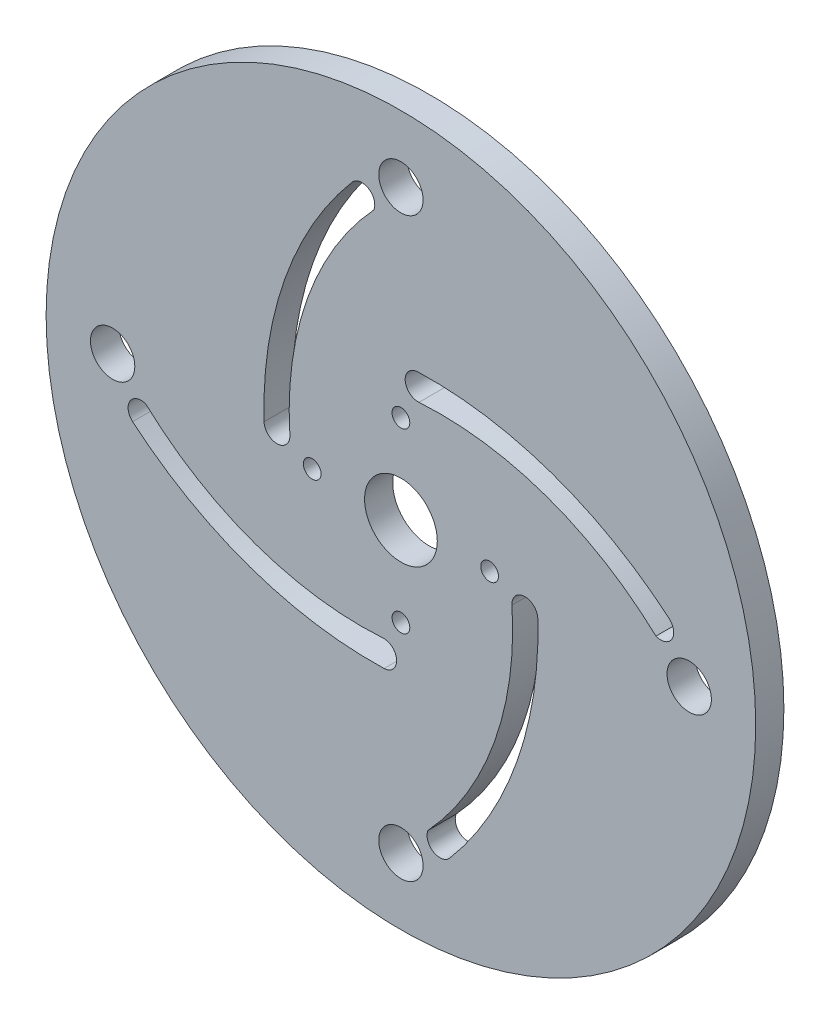
ISO-10303-21;
HEADER;
FILE_DESCRIPTION(('STEP AP214'),'2;1');
FILE_NAME('part.step','',(''),(''),'','','');
FILE_SCHEMA(('AUTOMOTIVE_DESIGN { 1 0 10303 214 1 1 1 1 }'));
ENDSEC;
DATA;
#1=APPLICATION_CONTEXT('core data for automotive mechanical design processes');
#2=APPLICATION_PROTOCOL_DEFINITION('international standard','automotive_design',2000,#1);
#3=PRODUCT_CONTEXT('',#1,'mechanical');
#4=PRODUCT('Part','Part','',(#3));
#5=PRODUCT_RELATED_PRODUCT_CATEGORY('part','',(#4));
#6=PRODUCT_DEFINITION_FORMATION('','',#4);
#7=PRODUCT_DEFINITION_CONTEXT('part definition',#1,'design');
#8=PRODUCT_DEFINITION('design','',#6,#7);
#9=PRODUCT_DEFINITION_SHAPE('','',#8);
#10=(LENGTH_UNIT() NAMED_UNIT(*) SI_UNIT(.MILLI.,.METRE.));
#11=(NAMED_UNIT(*) PLANE_ANGLE_UNIT() SI_UNIT($,.RADIAN.));
#12=(NAMED_UNIT(*) SI_UNIT($,.STERADIAN.) SOLID_ANGLE_UNIT());
#13=UNCERTAINTY_MEASURE_WITH_UNIT(LENGTH_MEASURE(1.E-05),#10,'distance_accuracy_value','');
#14=(GEOMETRIC_REPRESENTATION_CONTEXT(3) GLOBAL_UNCERTAINTY_ASSIGNED_CONTEXT((#13)) GLOBAL_UNIT_ASSIGNED_CONTEXT((#10,
#11,#12)) REPRESENTATION_CONTEXT('',''));
#15=CARTESIAN_POINT('',(0.,0.,0.));
#16=DIRECTION('',(0.,0.,1.));
#17=DIRECTION('',(1.,0.,0.));
#18=AXIS2_PLACEMENT_3D('',#15,#16,#17);
#19=CARTESIAN_POINT('',(0.,0.,3.175));
#20=DIRECTION('',(0.,0.,1.));
#21=DIRECTION('',(1.,0.,0.));
#22=AXIS2_PLACEMENT_3D('',#19,#20,#21);
#23=PLANE('',#22);
#24=CARTESIAN_POINT('',(-3.75211670479082E-13,-32.500000024,3.175));
#25=DIRECTION('',(0.,0.,1.));
#26=DIRECTION('',(1.,0.,0.));
#27=AXIS2_PLACEMENT_3D('',#24,#25,#26);
#28=CIRCLE('',#27,2.5);
#29=CARTESIAN_POINT('',(2.49999999999963,-32.500000024,3.175));
#30=VERTEX_POINT('',#29);
#31=EDGE_CURVE('E344',#30,#30,#28,.T.);
#32=ORIENTED_EDGE('',*,*,#31,.F.);
#33=EDGE_LOOP('',(#32));
#34=FACE_BOUND('',#33,.T.);
#35=CARTESIAN_POINT('',(0.,10.,3.175));
#36=DIRECTION('',(0.,0.,1.));
#37=DIRECTION('',(1.,0.,0.));
#38=AXIS2_PLACEMENT_3D('',#35,#36,#37);
#39=CIRCLE('',#38,1.);
#40=CARTESIAN_POINT('',(1.,10.,3.175));
#41=VERTEX_POINT('',#40);
#42=EDGE_CURVE('E360',#41,#41,#39,.T.);
#43=ORIENTED_EDGE('',*,*,#42,.F.);
#44=EDGE_LOOP('',(#43));
#45=FACE_BOUND('',#44,.T.);
#46=CARTESIAN_POINT('',(0.,-10.,3.175));
#47=DIRECTION('',(0.,0.,1.));
#48=DIRECTION('',(1.,0.,0.));
#49=AXIS2_PLACEMENT_3D('',#46,#47,#48);
#50=CIRCLE('',#49,1.);
#51=CARTESIAN_POINT('',(1.,-10.,3.175));
#52=VERTEX_POINT('',#51);
#53=EDGE_CURVE('E376',#52,#52,#50,.T.);
#54=ORIENTED_EDGE('',*,*,#53,.F.);
#55=EDGE_LOOP('',(#54));
#56=FACE_BOUND('',#55,.T.);
#57=CARTESIAN_POINT('',(10.,0.,3.175));
#58=DIRECTION('',(0.,0.,1.));
#59=DIRECTION('',(1.,0.,0.));
#60=AXIS2_PLACEMENT_3D('',#57,#58,#59);
#61=CIRCLE('',#60,1.);
#62=CARTESIAN_POINT('',(11.,0.,3.175));
#63=VERTEX_POINT('',#62);
#64=EDGE_CURVE('E392',#63,#63,#61,.T.);
#65=ORIENTED_EDGE('',*,*,#64,.F.);
#66=EDGE_LOOP('',(#65));
#67=FACE_BOUND('',#66,.T.);
#68=CARTESIAN_POINT('',(0.,0.,3.175));
#69=DIRECTION('',(0.,0.,1.));
#70=DIRECTION('',(1.,0.,0.));
#71=AXIS2_PLACEMENT_3D('',#68,#69,#70);
#72=CIRCLE('',#71,40.);
#73=CARTESIAN_POINT('',(40.,0.,3.175));
#74=VERTEX_POINT('',#73);
#75=EDGE_CURVE('E11',#74,#74,#72,.T.);
#76=ORIENTED_EDGE('',*,*,#75,.T.);
#77=EDGE_LOOP('',(#76));
#78=FACE_BOUND('',#77,.T.);
#79=CARTESIAN_POINT('',(0.,0.,3.175));
#80=DIRECTION('',(0.,0.,1.));
#81=DIRECTION('',(1.,0.,0.));
#82=AXIS2_PLACEMENT_3D('',#79,#80,#81);
#83=CIRCLE('',#82,4.1);
#84=CARTESIAN_POINT('',(4.1,0.,3.175));
#85=VERTEX_POINT('',#84);
#86=EDGE_CURVE('E400',#85,#85,#83,.T.);
#87=ORIENTED_EDGE('',*,*,#86,.F.);
#88=EDGE_LOOP('',(#87));
#89=FACE_BOUND('',#88,.T.);
#90=CARTESIAN_POINT('',(1.48265383286687E-13,32.500000024,3.175));
#91=DIRECTION('',(0.,0.,1.));
#92=DIRECTION('',(1.,0.,0.));
#93=AXIS2_PLACEMENT_3D('',#90,#91,#92);
#94=CIRCLE('',#93,2.5);
#95=CARTESIAN_POINT('',(2.50000000000015,32.500000024,3.175));
#96=VERTEX_POINT('',#95);
#97=EDGE_CURVE('E384',#96,#96,#94,.T.);
#98=ORIENTED_EDGE('',*,*,#97,.F.);
#99=EDGE_LOOP('',(#98));
#100=FACE_BOUND('',#99,.T.);
#101=CARTESIAN_POINT('',(-10.,0.,3.175));
#102=DIRECTION('',(0.,0.,1.));
#103=DIRECTION('',(1.,0.,0.));
#104=AXIS2_PLACEMENT_3D('',#101,#102,#103);
#105=CIRCLE('',#104,1.);
#106=CARTESIAN_POINT('',(-9.,0.,3.175));
#107=VERTEX_POINT('',#106);
#108=EDGE_CURVE('E368',#107,#107,#105,.T.);
#109=ORIENTED_EDGE('',*,*,#108,.F.);
#110=EDGE_LOOP('',(#109));
#111=FACE_BOUND('',#110,.T.);
#112=CARTESIAN_POINT('',(32.500000024,-2.68677420786791E-13,3.175));
#113=DIRECTION('',(0.,0.,1.));
#114=DIRECTION('',(1.,0.,0.));
#115=AXIS2_PLACEMENT_3D('',#112,#113,#114);
#116=CIRCLE('',#115,2.5);
#117=CARTESIAN_POINT('',(35.000000024,-2.68677420786791E-13,3.175));
#118=VERTEX_POINT('',#117);
#119=EDGE_CURVE('E352',#118,#118,#116,.T.);
#120=ORIENTED_EDGE('',*,*,#119,.F.);
#121=EDGE_LOOP('',(#120));
#122=FACE_BOUND('',#121,.T.);
#123=CARTESIAN_POINT('',(-32.500000024,4.88684814075279E-13,3.175));
#124=DIRECTION('',(0.,0.,1.));
#125=DIRECTION('',(1.,0.,0.));
#126=AXIS2_PLACEMENT_3D('',#123,#124,#125);
#127=CIRCLE('',#126,2.5);
#128=CARTESIAN_POINT('',(-30.000000024,4.88684814075279E-13,3.175));
#129=VERTEX_POINT('',#128);
#130=EDGE_CURVE('E336',#129,#129,#127,.T.);
#131=ORIENTED_EDGE('',*,*,#130,.F.);
#132=EDGE_LOOP('',(#131));
#133=FACE_BOUND('',#132,.T.);
#134=CARTESIAN_POINT('',(-23.2202833396125,-4.41366507691549,3.175));
#135=DIRECTION('',(0.,0.,-1.));
#136=DIRECTION('',(-1.,0.,0.));
#137=AXIS2_PLACEMENT_3D('',#134,#135,#136);
#138=CIRCLE('',#137,35.8185156656904);
#139=CARTESIAN_POINT('',(12.5190383342901,-2.03312925852839,3.175));
#140=VERTEX_POINT('',#139);
#141=CARTESIAN_POINT('',(3.05719626547229,-28.7541689767459,3.175));
#142=VERTEX_POINT('',#141);
#143=EDGE_CURVE('E296',#140,#142,#138,.T.);
#144=ORIENTED_EDGE('',*,*,#143,.F.);
#145=CARTESIAN_POINT('',(13.9727648667315,-1.93629899095386,3.175));
#146=DIRECTION('',(0.,0.,1.));
#147=DIRECTION('',(1.,0.,0.));
#148=AXIS2_PLACEMENT_3D('',#145,#146,#147);
#149=CIRCLE('',#148,1.45694781369915);
#150=CARTESIAN_POINT('',(15.4290656505906,-1.89288287903321,3.175));
#151=VERTEX_POINT('',#150);
#152=EDGE_CURVE('E293',#151,#140,#149,.T.);
#153=ORIENTED_EDGE('',*,*,#152,.F.);
#154=CARTESIAN_POINT('',(-26.464322347645,-3.14183367424383,3.175));
#155=DIRECTION('',(0.,0.,1.));
#156=DIRECTION('',(-1.,0.,0.));
#157=AXIS2_PLACEMENT_3D('',#154,#155,#156);
#158=CIRCLE('',#157,41.9120010982483);
#159=CARTESIAN_POINT('',(5.50574957064131,-30.244053834208,3.175));
#160=VERTEX_POINT('',#159);
#161=EDGE_CURVE('E304',#160,#151,#158,.T.);
#162=ORIENTED_EDGE('',*,*,#161,.F.);
#163=CARTESIAN_POINT('',(4.39905633511044,-29.305868778023,3.175));
#164=DIRECTION('',(0.,0.,1.));
#165=DIRECTION('',(1.,0.,0.));
#166=AXIS2_PLACEMENT_3D('',#163,#164,#165);
#167=CIRCLE('',#166,1.45084841290139);
#168=EDGE_CURVE('E300',#142,#160,#167,.T.);
#169=ORIENTED_EDGE('',*,*,#168,.F.);
#170=EDGE_LOOP('',(#144,#153,#162,#169));
#171=FACE_BOUND('',#170,.T.);
#172=CARTESIAN_POINT('',(4.41366507691547,-23.2202833396125,3.175));
#173=DIRECTION('',(0.,0.,-1.));
#174=DIRECTION('',(-1.,0.,0.));
#175=AXIS2_PLACEMENT_3D('',#172,#173,#174);
#176=CIRCLE('',#175,35.8185156656904);
#177=CARTESIAN_POINT('',(2.03312925852838,12.5190383342901,3.175));
#178=VERTEX_POINT('',#177);
#179=CARTESIAN_POINT('',(28.7541689767459,3.05719626547229,3.175));
#180=VERTEX_POINT('',#179);
#181=EDGE_CURVE('E253',#178,#180,#176,.T.);
#182=ORIENTED_EDGE('',*,*,#181,.F.);
#183=CARTESIAN_POINT('',(1.93629899095385,13.9727648667316,3.175));
#184=DIRECTION('',(0.,0.,1.));
#185=DIRECTION('',(1.,0.,0.));
#186=AXIS2_PLACEMENT_3D('',#183,#184,#185);
#187=CIRCLE('',#186,1.45694781369915);
#188=CARTESIAN_POINT('',(1.8928828790332,15.4290656505906,3.175));
#189=VERTEX_POINT('',#188);
#190=EDGE_CURVE('E250',#189,#178,#187,.T.);
#191=ORIENTED_EDGE('',*,*,#190,.F.);
#192=CARTESIAN_POINT('',(3.14183367424383,-26.464322347645,3.175));
#193=DIRECTION('',(0.,0.,1.));
#194=DIRECTION('',(-1.,0.,0.));
#195=AXIS2_PLACEMENT_3D('',#192,#193,#194);
#196=CIRCLE('',#195,41.9120010982483);
#197=CARTESIAN_POINT('',(30.244053834208,5.50574957064131,3.175));
#198=VERTEX_POINT('',#197);
#199=EDGE_CURVE('E261',#198,#189,#196,.T.);
#200=ORIENTED_EDGE('',*,*,#199,.F.);
#201=CARTESIAN_POINT('',(29.305868778023,4.39905633511044,3.175));
#202=DIRECTION('',(0.,0.,1.));
#203=DIRECTION('',(1.,0.,0.));
#204=AXIS2_PLACEMENT_3D('',#201,#202,#203);
#205=CIRCLE('',#204,1.45084841290139);
#206=EDGE_CURVE('E257',#180,#198,#205,.T.);
#207=ORIENTED_EDGE('',*,*,#206,.F.);
#208=EDGE_LOOP('',(#182,#191,#200,#207));
#209=FACE_BOUND('',#208,.T.);
#210=CARTESIAN_POINT('',(-4.41366507691548,23.2202833396125,3.175));
#211=DIRECTION('',(0.,0.,-1.));
#212=DIRECTION('',(-1.,0.,0.));
#213=AXIS2_PLACEMENT_3D('',#210,#211,#212);
#214=CIRCLE('',#213,35.8185156656904);
#215=CARTESIAN_POINT('',(-2.03312925852837,-12.5190383342901,3.175));
#216=VERTEX_POINT('',#215);
#217=CARTESIAN_POINT('',(-28.7541689767459,-3.05719626547229,3.175));
#218=VERTEX_POINT('',#217);
#219=EDGE_CURVE('E210',#216,#218,#214,.T.);
#220=ORIENTED_EDGE('',*,*,#219,.F.);
#221=CARTESIAN_POINT('',(-1.93629899095385,-13.9727648667316,3.175));
#222=DIRECTION('',(0.,0.,1.));
#223=DIRECTION('',(1.,0.,0.));
#224=AXIS2_PLACEMENT_3D('',#221,#222,#223);
#225=CIRCLE('',#224,1.45694781369915);
#226=CARTESIAN_POINT('',(-1.89288287903319,-15.4290656505906,3.175));
#227=VERTEX_POINT('',#226);
#228=EDGE_CURVE('E207',#227,#216,#225,.T.);
#229=ORIENTED_EDGE('',*,*,#228,.F.);
#230=CARTESIAN_POINT('',(-3.14183367424383,26.464322347645,3.175));
#231=DIRECTION('',(0.,0.,1.));
#232=DIRECTION('',(-1.,0.,0.));
#233=AXIS2_PLACEMENT_3D('',#230,#231,#232);
#234=CIRCLE('',#233,41.9120010982483);
#235=CARTESIAN_POINT('',(-30.244053834208,-5.50574957064132,3.175));
#236=VERTEX_POINT('',#235);
#237=EDGE_CURVE('E218',#236,#227,#234,.T.);
#238=ORIENTED_EDGE('',*,*,#237,.F.);
#239=CARTESIAN_POINT('',(-29.305868778023,-4.39905633511044,3.175));
#240=DIRECTION('',(0.,0.,1.));
#241=DIRECTION('',(1.,0.,0.));
#242=AXIS2_PLACEMENT_3D('',#239,#240,#241);
#243=CIRCLE('',#242,1.45084841290139);
#244=EDGE_CURVE('E214',#218,#236,#243,.T.);
#245=ORIENTED_EDGE('',*,*,#244,.F.);
#246=EDGE_LOOP('',(#220,#229,#238,#245));
#247=FACE_BOUND('',#246,.T.);
#248=CARTESIAN_POINT('',(23.2202833396125,4.41366507691549,3.175));
#249=DIRECTION('',(0.,0.,-1.));
#250=DIRECTION('',(-1.,0.,0.));
#251=AXIS2_PLACEMENT_3D('',#248,#249,#250);
#252=CIRCLE('',#251,35.8185156656904);
#253=CARTESIAN_POINT('',(-12.5190383342901,2.03312925852839,3.175));
#254=VERTEX_POINT('',#253);
#255=CARTESIAN_POINT('',(-3.0571962654723,28.7541689767459,3.175));
#256=VERTEX_POINT('',#255);
#257=EDGE_CURVE('E168',#254,#256,#252,.T.);
#258=ORIENTED_EDGE('',*,*,#257,.F.);
#259=CARTESIAN_POINT('',(-13.9727648667315,1.93629899095385,3.175));
#260=DIRECTION('',(0.,0.,1.));
#261=DIRECTION('',(1.,0.,0.));
#262=AXIS2_PLACEMENT_3D('',#259,#260,#261);
#263=CIRCLE('',#262,1.45694781369915);
#264=CARTESIAN_POINT('',(-15.4290656505906,1.89288287903319,3.175));
#265=VERTEX_POINT('',#264);
#266=EDGE_CURVE('E159',#265,#254,#263,.T.);
#267=ORIENTED_EDGE('',*,*,#266,.F.);
#268=CARTESIAN_POINT('',(26.464322347645,3.14183367424383,3.175));
#269=DIRECTION('',(0.,0.,1.));
#270=DIRECTION('',(-1.,0.,0.));
#271=AXIS2_PLACEMENT_3D('',#268,#269,#270);
#272=CIRCLE('',#271,41.9120010982483);
#273=CARTESIAN_POINT('',(-5.50574957064131,30.244053834208,3.175));
#274=VERTEX_POINT('',#273);
#275=EDGE_CURVE('E185',#274,#265,#272,.T.);
#276=ORIENTED_EDGE('',*,*,#275,.F.);
#277=CARTESIAN_POINT('',(-4.39905633511044,29.305868778023,3.175));
#278=DIRECTION('',(0.,0.,1.));
#279=DIRECTION('',(1.,0.,0.));
#280=AXIS2_PLACEMENT_3D('',#277,#278,#279);
#281=CIRCLE('',#280,1.45084841290139);
#282=EDGE_CURVE('E181',#256,#274,#281,.T.);
#283=ORIENTED_EDGE('',*,*,#282,.F.);
#284=EDGE_LOOP('',(#258,#267,#276,#283));
#285=FACE_BOUND('',#284,.T.);
#286=ADVANCED_FACE('F45',(#34,#45,#56,#67,#78,#89,#100,#111,#122,#133,#171,#209,#247,#285),#23,.T.);
#287=CARTESIAN_POINT('',(0.,0.,0.));
#288=DIRECTION('',(0.,0.,1.));
#289=DIRECTION('',(1.,0.,0.));
#290=AXIS2_PLACEMENT_3D('',#287,#288,#289);
#291=PLANE('',#290);
#292=CARTESIAN_POINT('',(-1.93629899095385,-13.9727648667316,0.));
#293=DIRECTION('',(0.,0.,1.));
#294=DIRECTION('',(1.,0.,0.));
#295=AXIS2_PLACEMENT_3D('',#292,#293,#294);
#296=CIRCLE('',#295,1.45694781369915);
#297=CARTESIAN_POINT('',(-1.89288287903319,-15.4290656505906,0.));
#298=VERTEX_POINT('',#297);
#299=CARTESIAN_POINT('',(-2.03312925852837,-12.5190383342901,0.));
#300=VERTEX_POINT('',#299);
#301=EDGE_CURVE('E177',#298,#300,#296,.T.);
#302=ORIENTED_EDGE('',*,*,#301,.T.);
#303=CARTESIAN_POINT('',(-4.41366507691548,23.2202833396125,0.));
#304=DIRECTION('',(0.,0.,-1.));
#305=DIRECTION('',(-1.,0.,0.));
#306=AXIS2_PLACEMENT_3D('',#303,#304,#305);
#307=CIRCLE('',#306,35.8185156656904);
#308=CARTESIAN_POINT('',(-28.7541689767459,-3.05719626547229,0.));
#309=VERTEX_POINT('',#308);
#310=EDGE_CURVE('E225',#300,#309,#307,.T.);
#311=ORIENTED_EDGE('',*,*,#310,.T.);
#312=CARTESIAN_POINT('',(-29.305868778023,-4.39905633511044,0.));
#313=DIRECTION('',(0.,0.,1.));
#314=DIRECTION('',(1.,0.,0.));
#315=AXIS2_PLACEMENT_3D('',#312,#313,#314);
#316=CIRCLE('',#315,1.45084841290139);
#317=CARTESIAN_POINT('',(-30.244053834208,-5.50574957064132,0.));
#318=VERTEX_POINT('',#317);
#319=EDGE_CURVE('E229',#309,#318,#316,.T.);
#320=ORIENTED_EDGE('',*,*,#319,.T.);
#321=CARTESIAN_POINT('',(-3.14183367424383,26.464322347645,0.));
#322=DIRECTION('',(0.,0.,1.));
#323=DIRECTION('',(-1.,0.,0.));
#324=AXIS2_PLACEMENT_3D('',#321,#322,#323);
#325=CIRCLE('',#324,41.9120010982483);
#326=EDGE_CURVE('E211',#318,#298,#325,.T.);
#327=ORIENTED_EDGE('',*,*,#326,.T.);
#328=EDGE_LOOP('',(#302,#311,#320,#327));
#329=FACE_BOUND('',#328,.T.);
#330=CARTESIAN_POINT('',(13.9727648667315,-1.93629899095386,0.));
#331=DIRECTION('',(0.,0.,1.));
#332=DIRECTION('',(1.,0.,0.));
#333=AXIS2_PLACEMENT_3D('',#330,#331,#332);
#334=CIRCLE('',#333,1.45694781369915);
#335=CARTESIAN_POINT('',(15.4290656505906,-1.89288287903321,0.));
#336=VERTEX_POINT('',#335);
#337=CARTESIAN_POINT('',(12.5190383342901,-2.03312925852839,0.));
#338=VERTEX_POINT('',#337);
#339=EDGE_CURVE('E292',#336,#338,#334,.T.);
#340=ORIENTED_EDGE('',*,*,#339,.T.);
#341=CARTESIAN_POINT('',(-23.2202833396125,-4.41366507691549,0.));
#342=DIRECTION('',(0.,0.,-1.));
#343=DIRECTION('',(-1.,0.,0.));
#344=AXIS2_PLACEMENT_3D('',#341,#342,#343);
#345=CIRCLE('',#344,35.8185156656904);
#346=CARTESIAN_POINT('',(3.05719626547229,-28.7541689767459,0.));
#347=VERTEX_POINT('',#346);
#348=EDGE_CURVE('E311',#338,#347,#345,.T.);
#349=ORIENTED_EDGE('',*,*,#348,.T.);
#350=CARTESIAN_POINT('',(4.39905633511044,-29.305868778023,0.));
#351=DIRECTION('',(0.,0.,1.));
#352=DIRECTION('',(1.,0.,0.));
#353=AXIS2_PLACEMENT_3D('',#350,#351,#352);
#354=CIRCLE('',#353,1.45084841290139);
#355=CARTESIAN_POINT('',(5.50574957064132,-30.244053834208,0.));
#356=VERTEX_POINT('',#355);
#357=EDGE_CURVE('E315',#347,#356,#354,.T.);
#358=ORIENTED_EDGE('',*,*,#357,.T.);
#359=CARTESIAN_POINT('',(-26.464322347645,-3.14183367424383,0.));
#360=DIRECTION('',(0.,0.,1.));
#361=DIRECTION('',(-1.,0.,0.));
#362=AXIS2_PLACEMENT_3D('',#359,#360,#361);
#363=CIRCLE('',#362,41.9120010982483);
#364=EDGE_CURVE('E297',#356,#336,#363,.T.);
#365=ORIENTED_EDGE('',*,*,#364,.T.);
#366=EDGE_LOOP('',(#340,#349,#358,#365));
#367=FACE_BOUND('',#366,.T.);
#368=CARTESIAN_POINT('',(0.,0.,0.));
#369=DIRECTION('',(0.,0.,1.));
#370=DIRECTION('',(1.,0.,0.));
#371=AXIS2_PLACEMENT_3D('',#368,#369,#370);
#372=CIRCLE('',#371,40.);
#373=CARTESIAN_POINT('',(40.,0.,0.));
#374=VERTEX_POINT('',#373);
#375=EDGE_CURVE('E49',#374,#374,#372,.T.);
#376=ORIENTED_EDGE('',*,*,#375,.F.);
#377=EDGE_LOOP('',(#376));
#378=FACE_BOUND('',#377,.T.);
#379=CARTESIAN_POINT('',(0.,0.,0.));
#380=DIRECTION('',(0.,0.,1.));
#381=DIRECTION('',(1.,0.,0.));
#382=AXIS2_PLACEMENT_3D('',#379,#380,#381);
#383=CIRCLE('',#382,4.1);
#384=CARTESIAN_POINT('',(4.1,0.,0.));
#385=VERTEX_POINT('',#384);
#386=EDGE_CURVE('E396',#385,#385,#383,.T.);
#387=ORIENTED_EDGE('',*,*,#386,.T.);
#388=EDGE_LOOP('',(#387));
#389=FACE_BOUND('',#388,.T.);
#390=CARTESIAN_POINT('',(10.,0.,0.));
#391=DIRECTION('',(0.,0.,1.));
#392=DIRECTION('',(1.,0.,0.));
#393=AXIS2_PLACEMENT_3D('',#390,#391,#392);
#394=CIRCLE('',#393,1.);
#395=CARTESIAN_POINT('',(11.,0.,0.));
#396=VERTEX_POINT('',#395);
#397=EDGE_CURVE('E388',#396,#396,#394,.T.);
#398=ORIENTED_EDGE('',*,*,#397,.T.);
#399=EDGE_LOOP('',(#398));
#400=FACE_BOUND('',#399,.T.);
#401=CARTESIAN_POINT('',(1.48265383286687E-13,32.500000024,0.));
#402=DIRECTION('',(0.,0.,1.));
#403=DIRECTION('',(1.,0.,0.));
#404=AXIS2_PLACEMENT_3D('',#401,#402,#403);
#405=CIRCLE('',#404,2.5);
#406=CARTESIAN_POINT('',(2.50000000000015,32.500000024,0.));
#407=VERTEX_POINT('',#406);
#408=EDGE_CURVE('E380',#407,#407,#405,.T.);
#409=ORIENTED_EDGE('',*,*,#408,.T.);
#410=EDGE_LOOP('',(#409));
#411=FACE_BOUND('',#410,.T.);
#412=CARTESIAN_POINT('',(0.,-10.,0.));
#413=DIRECTION('',(0.,0.,1.));
#414=DIRECTION('',(1.,0.,0.));
#415=AXIS2_PLACEMENT_3D('',#412,#413,#414);
#416=CIRCLE('',#415,1.);
#417=CARTESIAN_POINT('',(1.,-10.,0.));
#418=VERTEX_POINT('',#417);
#419=EDGE_CURVE('E372',#418,#418,#416,.T.);
#420=ORIENTED_EDGE('',*,*,#419,.T.);
#421=EDGE_LOOP('',(#420));
#422=FACE_BOUND('',#421,.T.);
#423=CARTESIAN_POINT('',(-10.,0.,0.));
#424=DIRECTION('',(0.,0.,1.));
#425=DIRECTION('',(1.,0.,0.));
#426=AXIS2_PLACEMENT_3D('',#423,#424,#425);
#427=CIRCLE('',#426,1.);
#428=CARTESIAN_POINT('',(-9.,0.,0.));
#429=VERTEX_POINT('',#428);
#430=EDGE_CURVE('E364',#429,#429,#427,.T.);
#431=ORIENTED_EDGE('',*,*,#430,.T.);
#432=EDGE_LOOP('',(#431));
#433=FACE_BOUND('',#432,.T.);
#434=CARTESIAN_POINT('',(0.,10.,0.));
#435=DIRECTION('',(0.,0.,1.));
#436=DIRECTION('',(1.,0.,0.));
#437=AXIS2_PLACEMENT_3D('',#434,#435,#436);
#438=CIRCLE('',#437,1.);
#439=CARTESIAN_POINT('',(1.,10.,0.));
#440=VERTEX_POINT('',#439);
#441=EDGE_CURVE('E356',#440,#440,#438,.T.);
#442=ORIENTED_EDGE('',*,*,#441,.T.);
#443=EDGE_LOOP('',(#442));
#444=FACE_BOUND('',#443,.T.);
#445=CARTESIAN_POINT('',(32.500000024,-2.68677420786791E-13,0.));
#446=DIRECTION('',(0.,0.,1.));
#447=DIRECTION('',(1.,0.,0.));
#448=AXIS2_PLACEMENT_3D('',#445,#446,#447);
#449=CIRCLE('',#448,2.5);
#450=CARTESIAN_POINT('',(35.000000024,-2.68677420786791E-13,0.));
#451=VERTEX_POINT('',#450);
#452=EDGE_CURVE('E348',#451,#451,#449,.T.);
#453=ORIENTED_EDGE('',*,*,#452,.T.);
#454=EDGE_LOOP('',(#453));
#455=FACE_BOUND('',#454,.T.);
#456=CARTESIAN_POINT('',(-3.75211670479082E-13,-32.500000024,0.));
#457=DIRECTION('',(0.,0.,1.));
#458=DIRECTION('',(1.,0.,0.));
#459=AXIS2_PLACEMENT_3D('',#456,#457,#458);
#460=CIRCLE('',#459,2.5);
#461=CARTESIAN_POINT('',(2.49999999999963,-32.500000024,0.));
#462=VERTEX_POINT('',#461);
#463=EDGE_CURVE('E340',#462,#462,#460,.T.);
#464=ORIENTED_EDGE('',*,*,#463,.T.);
#465=EDGE_LOOP('',(#464));
#466=FACE_BOUND('',#465,.T.);
#467=CARTESIAN_POINT('',(-32.500000024,4.88684814075279E-13,0.));
#468=DIRECTION('',(0.,0.,1.));
#469=DIRECTION('',(1.,0.,0.));
#470=AXIS2_PLACEMENT_3D('',#467,#468,#469);
#471=CIRCLE('',#470,2.5);
#472=CARTESIAN_POINT('',(-30.000000024,4.88684814075279E-13,0.));
#473=VERTEX_POINT('',#472);
#474=EDGE_CURVE('E335',#473,#473,#471,.T.);
#475=ORIENTED_EDGE('',*,*,#474,.T.);
#476=EDGE_LOOP('',(#475));
#477=FACE_BOUND('',#476,.T.);
#478=CARTESIAN_POINT('',(1.93629899095385,13.9727648667316,0.));
#479=DIRECTION('',(0.,0.,1.));
#480=DIRECTION('',(1.,0.,0.));
#481=AXIS2_PLACEMENT_3D('',#478,#479,#480);
#482=CIRCLE('',#481,1.45694781369915);
#483=CARTESIAN_POINT('',(1.8928828790332,15.4290656505906,0.));
#484=VERTEX_POINT('',#483);
#485=CARTESIAN_POINT('',(2.03312925852838,12.5190383342901,0.));
#486=VERTEX_POINT('',#485);
#487=EDGE_CURVE('E249',#484,#486,#482,.T.);
#488=ORIENTED_EDGE('',*,*,#487,.T.);
#489=CARTESIAN_POINT('',(4.41366507691547,-23.2202833396125,0.));
#490=DIRECTION('',(0.,0.,-1.));
#491=DIRECTION('',(-1.,0.,0.));
#492=AXIS2_PLACEMENT_3D('',#489,#490,#491);
#493=CIRCLE('',#492,35.8185156656904);
#494=CARTESIAN_POINT('',(28.7541689767459,3.05719626547229,0.));
#495=VERTEX_POINT('',#494);
#496=EDGE_CURVE('E268',#486,#495,#493,.T.);
#497=ORIENTED_EDGE('',*,*,#496,.T.);
#498=CARTESIAN_POINT('',(29.305868778023,4.39905633511044,0.));
#499=DIRECTION('',(0.,0.,1.));
#500=DIRECTION('',(1.,0.,0.));
#501=AXIS2_PLACEMENT_3D('',#498,#499,#500);
#502=CIRCLE('',#501,1.45084841290139);
#503=CARTESIAN_POINT('',(30.244053834208,5.50574957064131,0.));
#504=VERTEX_POINT('',#503);
#505=EDGE_CURVE('E272',#495,#504,#502,.T.);
#506=ORIENTED_EDGE('',*,*,#505,.T.);
#507=CARTESIAN_POINT('',(3.14183367424383,-26.464322347645,0.));
#508=DIRECTION('',(0.,0.,1.));
#509=DIRECTION('',(-1.,0.,0.));
#510=AXIS2_PLACEMENT_3D('',#507,#508,#509);
#511=CIRCLE('',#510,41.9120010982483);
#512=EDGE_CURVE('E254',#504,#484,#511,.T.);
#513=ORIENTED_EDGE('',*,*,#512,.T.);
#514=EDGE_LOOP('',(#488,#497,#506,#513));
#515=FACE_BOUND('',#514,.T.);
#516=CARTESIAN_POINT('',(-13.9727648667315,1.93629899095385,0.));
#517=DIRECTION('',(0.,0.,1.));
#518=DIRECTION('',(1.,0.,0.));
#519=AXIS2_PLACEMENT_3D('',#516,#517,#518);
#520=CIRCLE('',#519,1.45694781369915);
#521=CARTESIAN_POINT('',(-15.4290656505906,1.89288287903319,0.));
#522=VERTEX_POINT('',#521);
#523=CARTESIAN_POINT('',(-12.5190383342901,2.03312925852839,0.));
#524=VERTEX_POINT('',#523);
#525=EDGE_CURVE('E69',#522,#524,#520,.T.);
#526=ORIENTED_EDGE('',*,*,#525,.T.);
#527=CARTESIAN_POINT('',(23.2202833396125,4.41366507691549,0.));
#528=DIRECTION('',(0.,0.,-1.));
#529=DIRECTION('',(-1.,0.,0.));
#530=AXIS2_PLACEMENT_3D('',#527,#528,#529);
#531=CIRCLE('',#530,35.8185156656904);
#532=CARTESIAN_POINT('',(-3.0571962654723,28.7541689767459,0.));
#533=VERTEX_POINT('',#532);
#534=EDGE_CURVE('E175',#524,#533,#531,.T.);
#535=ORIENTED_EDGE('',*,*,#534,.T.);
#536=CARTESIAN_POINT('',(-4.39905633511044,29.305868778023,0.));
#537=DIRECTION('',(0.,0.,1.));
#538=DIRECTION('',(1.,0.,0.));
#539=AXIS2_PLACEMENT_3D('',#536,#537,#538);
#540=CIRCLE('',#539,1.45084841290139);
#541=CARTESIAN_POINT('',(-5.50574957064131,30.244053834208,0.));
#542=VERTEX_POINT('',#541);
#543=EDGE_CURVE('E194',#533,#542,#540,.T.);
#544=ORIENTED_EDGE('',*,*,#543,.T.);
#545=CARTESIAN_POINT('',(26.464322347645,3.14183367424383,0.));
#546=DIRECTION('',(0.,0.,1.));
#547=DIRECTION('',(-1.,0.,0.));
#548=AXIS2_PLACEMENT_3D('',#545,#546,#547);
#549=CIRCLE('',#548,41.9120010982483);
#550=EDGE_CURVE('E169',#542,#522,#549,.T.);
#551=ORIENTED_EDGE('',*,*,#550,.T.);
#552=EDGE_LOOP('',(#526,#535,#544,#551));
#553=FACE_BOUND('',#552,.T.);
#554=ADVANCED_FACE('F408',(#329,#367,#378,#389,#400,#411,#422,#433,#444,#455,#466,#477,#515,
#553),#291,.F.);
#555=CARTESIAN_POINT('',(0.,0.,3.175));
#556=DIRECTION('',(0.,0.,-1.));
#557=DIRECTION('',(-1.,0.,0.));
#558=AXIS2_PLACEMENT_3D('',#555,#556,#557);
#559=CYLINDRICAL_SURFACE('',#558,40.);
#560=ORIENTED_EDGE('',*,*,#75,.F.);
#561=EDGE_LOOP('',(#560));
#562=FACE_BOUND('',#561,.T.);
#563=ORIENTED_EDGE('',*,*,#375,.T.);
#564=EDGE_LOOP('',(#563));
#565=FACE_BOUND('',#564,.T.);
#566=ADVANCED_FACE('F47',(#562,#565),#559,.T.);
#567=CARTESIAN_POINT('',(0.,0.,3.175));
#568=DIRECTION('',(0.,0.,-1.));
#569=DIRECTION('',(-1.,0.,0.));
#570=AXIS2_PLACEMENT_3D('',#567,#568,#569);
#571=CYLINDRICAL_SURFACE('',#570,4.1);
#572=ORIENTED_EDGE('',*,*,#86,.T.);
#573=EDGE_LOOP('',(#572));
#574=FACE_BOUND('',#573,.T.);
#575=ORIENTED_EDGE('',*,*,#386,.F.);
#576=EDGE_LOOP('',(#575));
#577=FACE_BOUND('',#576,.T.);
#578=ADVANCED_FACE('F411',(#574,#577),#571,.F.);
#579=CARTESIAN_POINT('',(10.,0.,3.175));
#580=DIRECTION('',(0.,0.,-1.));
#581=DIRECTION('',(-1.,0.,0.));
#582=AXIS2_PLACEMENT_3D('',#579,#580,#581);
#583=CYLINDRICAL_SURFACE('',#582,1.);
#584=ORIENTED_EDGE('',*,*,#64,.T.);
#585=EDGE_LOOP('',(#584));
#586=FACE_BOUND('',#585,.T.);
#587=ORIENTED_EDGE('',*,*,#397,.F.);
#588=EDGE_LOOP('',(#587));
#589=FACE_BOUND('',#588,.T.);
#590=ADVANCED_FACE('F413',(#586,#589),#583,.F.);
#591=CARTESIAN_POINT('',(1.48265383286687E-13,32.500000024,3.175));
#592=DIRECTION('',(0.,0.,-1.));
#593=DIRECTION('',(-1.,0.,0.));
#594=AXIS2_PLACEMENT_3D('',#591,#592,#593);
#595=CYLINDRICAL_SURFACE('',#594,2.5);
#596=ORIENTED_EDGE('',*,*,#97,.T.);
#597=EDGE_LOOP('',(#596));
#598=FACE_BOUND('',#597,.T.);
#599=ORIENTED_EDGE('',*,*,#408,.F.);
#600=EDGE_LOOP('',(#599));
#601=FACE_BOUND('',#600,.T.);
#602=ADVANCED_FACE('F420',(#598,#601),#595,.F.);
#603=CARTESIAN_POINT('',(0.,-10.,3.175));
#604=DIRECTION('',(0.,0.,-1.));
#605=DIRECTION('',(-1.,0.,0.));
#606=AXIS2_PLACEMENT_3D('',#603,#604,#605);
#607=CYLINDRICAL_SURFACE('',#606,1.);
#608=ORIENTED_EDGE('',*,*,#53,.T.);
#609=EDGE_LOOP('',(#608));
#610=FACE_BOUND('',#609,.T.);
#611=ORIENTED_EDGE('',*,*,#419,.F.);
#612=EDGE_LOOP('',(#611));
#613=FACE_BOUND('',#612,.T.);
#614=ADVANCED_FACE('F542',(#610,#613),#607,.F.);
#615=CARTESIAN_POINT('',(-10.,0.,3.175));
#616=DIRECTION('',(0.,0.,-1.));
#617=DIRECTION('',(-1.,0.,0.));
#618=AXIS2_PLACEMENT_3D('',#615,#616,#617);
#619=CYLINDRICAL_SURFACE('',#618,1.);
#620=ORIENTED_EDGE('',*,*,#108,.T.);
#621=EDGE_LOOP('',(#620));
#622=FACE_BOUND('',#621,.T.);
#623=ORIENTED_EDGE('',*,*,#430,.F.);
#624=EDGE_LOOP('',(#623));
#625=FACE_BOUND('',#624,.T.);
#626=ADVANCED_FACE('F538',(#622,#625),#619,.F.);
#627=CARTESIAN_POINT('',(0.,10.,3.175));
#628=DIRECTION('',(0.,0.,-1.));
#629=DIRECTION('',(-1.,0.,0.));
#630=AXIS2_PLACEMENT_3D('',#627,#628,#629);
#631=CYLINDRICAL_SURFACE('',#630,1.);
#632=ORIENTED_EDGE('',*,*,#42,.T.);
#633=EDGE_LOOP('',(#632));
#634=FACE_BOUND('',#633,.T.);
#635=ORIENTED_EDGE('',*,*,#441,.F.);
#636=EDGE_LOOP('',(#635));
#637=FACE_BOUND('',#636,.T.);
#638=ADVANCED_FACE('F534',(#634,#637),#631,.F.);
#639=CARTESIAN_POINT('',(32.500000024,-2.68677420786791E-13,3.175));
#640=DIRECTION('',(0.,0.,-1.));
#641=DIRECTION('',(-1.,0.,0.));
#642=AXIS2_PLACEMENT_3D('',#639,#640,#641);
#643=CYLINDRICAL_SURFACE('',#642,2.5);
#644=ORIENTED_EDGE('',*,*,#119,.T.);
#645=EDGE_LOOP('',(#644));
#646=FACE_BOUND('',#645,.T.);
#647=ORIENTED_EDGE('',*,*,#452,.F.);
#648=EDGE_LOOP('',(#647));
#649=FACE_BOUND('',#648,.T.);
#650=ADVANCED_FACE('F530',(#646,#649),#643,.F.);
#651=CARTESIAN_POINT('',(-3.75211670479082E-13,-32.500000024,3.175));
#652=DIRECTION('',(0.,0.,-1.));
#653=DIRECTION('',(-1.,0.,0.));
#654=AXIS2_PLACEMENT_3D('',#651,#652,#653);
#655=CYLINDRICAL_SURFACE('',#654,2.5);
#656=ORIENTED_EDGE('',*,*,#31,.T.);
#657=EDGE_LOOP('',(#656));
#658=FACE_BOUND('',#657,.T.);
#659=ORIENTED_EDGE('',*,*,#463,.F.);
#660=EDGE_LOOP('',(#659));
#661=FACE_BOUND('',#660,.T.);
#662=ADVANCED_FACE('F526',(#658,#661),#655,.F.);
#663=CARTESIAN_POINT('',(-32.500000024,4.88684814075279E-13,3.175));
#664=DIRECTION('',(0.,0.,-1.));
#665=DIRECTION('',(-1.,0.,0.));
#666=AXIS2_PLACEMENT_3D('',#663,#664,#665);
#667=CYLINDRICAL_SURFACE('',#666,2.5);
#668=ORIENTED_EDGE('',*,*,#130,.T.);
#669=EDGE_LOOP('',(#668));
#670=FACE_BOUND('',#669,.T.);
#671=ORIENTED_EDGE('',*,*,#474,.F.);
#672=EDGE_LOOP('',(#671));
#673=FACE_BOUND('',#672,.T.);
#674=ADVANCED_FACE('F522',(#670,#673),#667,.F.);
#675=CARTESIAN_POINT('',(13.9727648667315,-1.93629899095386,3.175));
#676=DIRECTION('',(0.,0.,-1.));
#677=DIRECTION('',(-1.,0.,0.));
#678=AXIS2_PLACEMENT_3D('',#675,#676,#677);
#679=CYLINDRICAL_SURFACE('',#678,1.45694781369915);
#680=ORIENTED_EDGE('',*,*,#339,.F.);
#681=DIRECTION('',(0.,0.,-1.));
#682=VECTOR('',#681,1.);
#683=CARTESIAN_POINT('',(15.4290656505906,-1.89288287903321,3.175));
#684=LINE('',#683,#682);
#685=EDGE_CURVE('E307',#151,#336,#684,.T.);
#686=ORIENTED_EDGE('',*,*,#685,.F.);
#687=ORIENTED_EDGE('',*,*,#152,.T.);
#688=DIRECTION('',(0.,0.,-1.));
#689=VECTOR('',#688,1.);
#690=CARTESIAN_POINT('',(12.5190383342901,-2.03312925852839,3.175));
#691=LINE('',#690,#689);
#692=EDGE_CURVE('E331',#140,#338,#691,.T.);
#693=ORIENTED_EDGE('',*,*,#692,.T.);
#694=EDGE_LOOP('',(#680,#686,#687,#693));
#695=FACE_BOUND('',#694,.T.);
#696=ADVANCED_FACE('F518',(#695),#679,.F.);
#697=CARTESIAN_POINT('',(-23.2202833396125,-4.41366507691549,3.175));
#698=DIRECTION('',(0.,0.,-1.));
#699=DIRECTION('',(-1.,0.,0.));
#700=AXIS2_PLACEMENT_3D('',#697,#698,#699);
#701=CYLINDRICAL_SURFACE('',#700,35.8185156656904);
#702=ORIENTED_EDGE('',*,*,#348,.F.);
#703=ORIENTED_EDGE('',*,*,#692,.F.);
#704=ORIENTED_EDGE('',*,*,#143,.T.);
#705=DIRECTION('',(0.,0.,-1.));
#706=VECTOR('',#705,1.);
#707=CARTESIAN_POINT('',(3.05719626547229,-28.7541689767459,3.175));
#708=LINE('',#707,#706);
#709=EDGE_CURVE('E328',#142,#347,#708,.T.);
#710=ORIENTED_EDGE('',*,*,#709,.T.);
#711=EDGE_LOOP('',(#702,#703,#704,#710));
#712=FACE_BOUND('',#711,.T.);
#713=ADVANCED_FACE('F514',(#712),#701,.T.);
#714=CARTESIAN_POINT('',(4.39905633511044,-29.305868778023,3.175));
#715=DIRECTION('',(0.,0.,-1.));
#716=DIRECTION('',(-1.,0.,0.));
#717=AXIS2_PLACEMENT_3D('',#714,#715,#716);
#718=CYLINDRICAL_SURFACE('',#717,1.45084841290139);
#719=ORIENTED_EDGE('',*,*,#357,.F.);
#720=ORIENTED_EDGE('',*,*,#709,.F.);
#721=ORIENTED_EDGE('',*,*,#168,.T.);
#722=DIRECTION('',(0.,0.,-1.));
#723=VECTOR('',#722,1.);
#724=CARTESIAN_POINT('',(5.50574957064132,-30.244053834208,3.175));
#725=LINE('',#724,#723);
#726=EDGE_CURVE('E325',#160,#356,#725,.T.);
#727=ORIENTED_EDGE('',*,*,#726,.T.);
#728=EDGE_LOOP('',(#719,#720,#721,#727));
#729=FACE_BOUND('',#728,.T.);
#730=ADVANCED_FACE('F510',(#729),#718,.F.);
#731=CARTESIAN_POINT('',(-26.464322347645,-3.14183367424383,3.175));
#732=DIRECTION('',(0.,0.,-1.));
#733=DIRECTION('',(-1.,0.,0.));
#734=AXIS2_PLACEMENT_3D('',#731,#732,#733);
#735=CYLINDRICAL_SURFACE('',#734,41.9120010982483);
#736=ORIENTED_EDGE('',*,*,#364,.F.);
#737=ORIENTED_EDGE('',*,*,#726,.F.);
#738=ORIENTED_EDGE('',*,*,#161,.T.);
#739=ORIENTED_EDGE('',*,*,#685,.T.);
#740=EDGE_LOOP('',(#736,#737,#738,#739));
#741=FACE_BOUND('',#740,.T.);
#742=ADVANCED_FACE('F506',(#741),#735,.F.);
#743=CARTESIAN_POINT('',(1.93629899095385,13.9727648667316,3.175));
#744=DIRECTION('',(0.,0.,-1.));
#745=DIRECTION('',(-1.,0.,0.));
#746=AXIS2_PLACEMENT_3D('',#743,#744,#745);
#747=CYLINDRICAL_SURFACE('',#746,1.45694781369915);
#748=ORIENTED_EDGE('',*,*,#487,.F.);
#749=DIRECTION('',(0.,0.,-1.));
#750=VECTOR('',#749,1.);
#751=CARTESIAN_POINT('',(1.8928828790332,15.4290656505906,3.175));
#752=LINE('',#751,#750);
#753=EDGE_CURVE('E264',#189,#484,#752,.T.);
#754=ORIENTED_EDGE('',*,*,#753,.F.);
#755=ORIENTED_EDGE('',*,*,#190,.T.);
#756=DIRECTION('',(0.,0.,-1.));
#757=VECTOR('',#756,1.);
#758=CARTESIAN_POINT('',(2.03312925852838,12.5190383342901,3.175));
#759=LINE('',#758,#757);
#760=EDGE_CURVE('E288',#178,#486,#759,.T.);
#761=ORIENTED_EDGE('',*,*,#760,.T.);
#762=EDGE_LOOP('',(#748,#754,#755,#761));
#763=FACE_BOUND('',#762,.T.);
#764=ADVANCED_FACE('F502',(#763),#747,.F.);
#765=CARTESIAN_POINT('',(4.41366507691547,-23.2202833396125,3.175));
#766=DIRECTION('',(0.,0.,-1.));
#767=DIRECTION('',(-1.,0.,0.));
#768=AXIS2_PLACEMENT_3D('',#765,#766,#767);
#769=CYLINDRICAL_SURFACE('',#768,35.8185156656904);
#770=ORIENTED_EDGE('',*,*,#496,.F.);
#771=ORIENTED_EDGE('',*,*,#760,.F.);
#772=ORIENTED_EDGE('',*,*,#181,.T.);
#773=DIRECTION('',(0.,0.,-1.));
#774=VECTOR('',#773,1.);
#775=CARTESIAN_POINT('',(28.7541689767459,3.05719626547229,3.175));
#776=LINE('',#775,#774);
#777=EDGE_CURVE('E285',#180,#495,#776,.T.);
#778=ORIENTED_EDGE('',*,*,#777,.T.);
#779=EDGE_LOOP('',(#770,#771,#772,#778));
#780=FACE_BOUND('',#779,.T.);
#781=ADVANCED_FACE('F498',(#780),#769,.T.);
#782=CARTESIAN_POINT('',(29.305868778023,4.39905633511044,3.175));
#783=DIRECTION('',(0.,0.,-1.));
#784=DIRECTION('',(-1.,0.,0.));
#785=AXIS2_PLACEMENT_3D('',#782,#783,#784);
#786=CYLINDRICAL_SURFACE('',#785,1.45084841290139);
#787=ORIENTED_EDGE('',*,*,#505,.F.);
#788=ORIENTED_EDGE('',*,*,#777,.F.);
#789=ORIENTED_EDGE('',*,*,#206,.T.);
#790=DIRECTION('',(0.,0.,-1.));
#791=VECTOR('',#790,1.);
#792=CARTESIAN_POINT('',(30.244053834208,5.50574957064131,3.175));
#793=LINE('',#792,#791);
#794=EDGE_CURVE('E282',#198,#504,#793,.T.);
#795=ORIENTED_EDGE('',*,*,#794,.T.);
#796=EDGE_LOOP('',(#787,#788,#789,#795));
#797=FACE_BOUND('',#796,.T.);
#798=ADVANCED_FACE('F494',(#797),#786,.F.);
#799=CARTESIAN_POINT('',(3.14183367424383,-26.464322347645,3.175));
#800=DIRECTION('',(0.,0.,-1.));
#801=DIRECTION('',(-1.,0.,0.));
#802=AXIS2_PLACEMENT_3D('',#799,#800,#801);
#803=CYLINDRICAL_SURFACE('',#802,41.9120010982483);
#804=ORIENTED_EDGE('',*,*,#512,.F.);
#805=ORIENTED_EDGE('',*,*,#794,.F.);
#806=ORIENTED_EDGE('',*,*,#199,.T.);
#807=ORIENTED_EDGE('',*,*,#753,.T.);
#808=EDGE_LOOP('',(#804,#805,#806,#807));
#809=FACE_BOUND('',#808,.T.);
#810=ADVANCED_FACE('F491',(#809),#803,.F.);
#811=CARTESIAN_POINT('',(-1.93629899095385,-13.9727648667316,3.175));
#812=DIRECTION('',(0.,0.,-1.));
#813=DIRECTION('',(-1.,0.,0.));
#814=AXIS2_PLACEMENT_3D('',#811,#812,#813);
#815=CYLINDRICAL_SURFACE('',#814,1.45694781369915);
#816=ORIENTED_EDGE('',*,*,#301,.F.);
#817=DIRECTION('',(0.,0.,-1.));
#818=VECTOR('',#817,1.);
#819=CARTESIAN_POINT('',(-1.89288287903319,-15.4290656505906,3.175));
#820=LINE('',#819,#818);
#821=EDGE_CURVE('E221',#227,#298,#820,.T.);
#822=ORIENTED_EDGE('',*,*,#821,.F.);
#823=ORIENTED_EDGE('',*,*,#228,.T.);
#824=DIRECTION('',(0.,0.,-1.));
#825=VECTOR('',#824,1.);
#826=CARTESIAN_POINT('',(-2.03312925852837,-12.5190383342901,3.175));
#827=LINE('',#826,#825);
#828=EDGE_CURVE('E245',#216,#300,#827,.T.);
#829=ORIENTED_EDGE('',*,*,#828,.T.);
#830=EDGE_LOOP('',(#816,#822,#823,#829));
#831=FACE_BOUND('',#830,.T.);
#832=ADVANCED_FACE('F473',(#831),#815,.F.);
#833=CARTESIAN_POINT('',(-4.41366507691548,23.2202833396125,3.175));
#834=DIRECTION('',(0.,0.,-1.));
#835=DIRECTION('',(-1.,0.,0.));
#836=AXIS2_PLACEMENT_3D('',#833,#834,#835);
#837=CYLINDRICAL_SURFACE('',#836,35.8185156656904);
#838=ORIENTED_EDGE('',*,*,#310,.F.);
#839=ORIENTED_EDGE('',*,*,#828,.F.);
#840=ORIENTED_EDGE('',*,*,#219,.T.);
#841=DIRECTION('',(0.,0.,-1.));
#842=VECTOR('',#841,1.);
#843=CARTESIAN_POINT('',(-28.7541689767459,-3.05719626547229,3.175));
#844=LINE('',#843,#842);
#845=EDGE_CURVE('E242',#218,#309,#844,.T.);
#846=ORIENTED_EDGE('',*,*,#845,.T.);
#847=EDGE_LOOP('',(#838,#839,#840,#846));
#848=FACE_BOUND('',#847,.T.);
#849=ADVANCED_FACE('F466',(#848),#837,.T.);
#850=CARTESIAN_POINT('',(-29.305868778023,-4.39905633511044,3.175));
#851=DIRECTION('',(0.,0.,-1.));
#852=DIRECTION('',(-1.,0.,0.));
#853=AXIS2_PLACEMENT_3D('',#850,#851,#852);
#854=CYLINDRICAL_SURFACE('',#853,1.45084841290139);
#855=ORIENTED_EDGE('',*,*,#319,.F.);
#856=ORIENTED_EDGE('',*,*,#845,.F.);
#857=ORIENTED_EDGE('',*,*,#244,.T.);
#858=DIRECTION('',(0.,0.,-1.));
#859=VECTOR('',#858,1.);
#860=CARTESIAN_POINT('',(-30.244053834208,-5.50574957064132,3.175));
#861=LINE('',#860,#859);
#862=EDGE_CURVE('E239',#236,#318,#861,.T.);
#863=ORIENTED_EDGE('',*,*,#862,.T.);
#864=EDGE_LOOP('',(#855,#856,#857,#863));
#865=FACE_BOUND('',#864,.T.);
#866=ADVANCED_FACE('F469',(#865),#854,.F.);
#867=CARTESIAN_POINT('',(-3.14183367424383,26.464322347645,3.175));
#868=DIRECTION('',(0.,0.,-1.));
#869=DIRECTION('',(-1.,0.,0.));
#870=AXIS2_PLACEMENT_3D('',#867,#868,#869);
#871=CYLINDRICAL_SURFACE('',#870,41.9120010982483);
#872=ORIENTED_EDGE('',*,*,#326,.F.);
#873=ORIENTED_EDGE('',*,*,#862,.F.);
#874=ORIENTED_EDGE('',*,*,#237,.T.);
#875=ORIENTED_EDGE('',*,*,#821,.T.);
#876=EDGE_LOOP('',(#872,#873,#874,#875));
#877=FACE_BOUND('',#876,.T.);
#878=ADVANCED_FACE('F476',(#877),#871,.F.);
#879=CARTESIAN_POINT('',(-13.9727648667315,1.93629899095385,3.175));
#880=DIRECTION('',(0.,0.,-1.));
#881=DIRECTION('',(-1.,0.,0.));
#882=AXIS2_PLACEMENT_3D('',#879,#880,#881);
#883=CYLINDRICAL_SURFACE('',#882,1.45694781369915);
#884=ORIENTED_EDGE('',*,*,#525,.F.);
#885=DIRECTION('',(0.,0.,-1.));
#886=VECTOR('',#885,1.);
#887=CARTESIAN_POINT('',(-15.4290656505906,1.89288287903319,3.175));
#888=LINE('',#887,#886);
#889=EDGE_CURVE('E163',#265,#522,#888,.T.);
#890=ORIENTED_EDGE('',*,*,#889,.F.);
#891=ORIENTED_EDGE('',*,*,#266,.T.);
#892=DIRECTION('',(0.,0.,-1.));
#893=VECTOR('',#892,1.);
#894=CARTESIAN_POINT('',(-12.5190383342901,2.03312925852839,3.175));
#895=LINE('',#894,#893);
#896=EDGE_CURVE('E162',#254,#524,#895,.T.);
#897=ORIENTED_EDGE('',*,*,#896,.T.);
#898=EDGE_LOOP('',(#884,#890,#891,#897));
#899=FACE_BOUND('',#898,.T.);
#900=ADVANCED_FACE('F161',(#899),#883,.F.);
#901=CARTESIAN_POINT('',(23.2202833396125,4.41366507691549,3.175));
#902=DIRECTION('',(0.,0.,-1.));
#903=DIRECTION('',(-1.,0.,0.));
#904=AXIS2_PLACEMENT_3D('',#901,#902,#903);
#905=CYLINDRICAL_SURFACE('',#904,35.8185156656904);
#906=ORIENTED_EDGE('',*,*,#534,.F.);
#907=ORIENTED_EDGE('',*,*,#896,.F.);
#908=ORIENTED_EDGE('',*,*,#257,.T.);
#909=DIRECTION('',(0.,0.,-1.));
#910=VECTOR('',#909,1.);
#911=CARTESIAN_POINT('',(-3.0571962654723,28.7541689767459,3.175));
#912=LINE('',#911,#910);
#913=EDGE_CURVE('E178',#256,#533,#912,.T.);
#914=ORIENTED_EDGE('',*,*,#913,.T.);
#915=EDGE_LOOP('',(#906,#907,#908,#914));
#916=FACE_BOUND('',#915,.T.);
#917=ADVANCED_FACE('F172',(#916),#905,.T.);
#918=CARTESIAN_POINT('',(-4.39905633511044,29.305868778023,3.175));
#919=DIRECTION('',(0.,0.,-1.));
#920=DIRECTION('',(-1.,0.,0.));
#921=AXIS2_PLACEMENT_3D('',#918,#919,#920);
#922=CYLINDRICAL_SURFACE('',#921,1.45084841290139);
#923=ORIENTED_EDGE('',*,*,#543,.F.);
#924=ORIENTED_EDGE('',*,*,#913,.F.);
#925=ORIENTED_EDGE('',*,*,#282,.T.);
#926=DIRECTION('',(0.,0.,-1.));
#927=VECTOR('',#926,1.);
#928=CARTESIAN_POINT('',(-5.50574957064131,30.244053834208,3.175));
#929=LINE('',#928,#927);
#930=EDGE_CURVE('E61',#274,#542,#929,.T.);
#931=ORIENTED_EDGE('',*,*,#930,.T.);
#932=EDGE_LOOP('',(#923,#924,#925,#931));
#933=FACE_BOUND('',#932,.T.);
#934=ADVANCED_FACE('F571',(#933),#922,.F.);
#935=CARTESIAN_POINT('',(26.464322347645,3.14183367424383,3.175));
#936=DIRECTION('',(0.,0.,-1.));
#937=DIRECTION('',(-1.,0.,0.));
#938=AXIS2_PLACEMENT_3D('',#935,#936,#937);
#939=CYLINDRICAL_SURFACE('',#938,41.9120010982483);
#940=ORIENTED_EDGE('',*,*,#550,.F.);
#941=ORIENTED_EDGE('',*,*,#930,.F.);
#942=ORIENTED_EDGE('',*,*,#275,.T.);
#943=ORIENTED_EDGE('',*,*,#889,.T.);
#944=EDGE_LOOP('',(#940,#941,#942,#943));
#945=FACE_BOUND('',#944,.T.);
#946=ADVANCED_FACE('F569',(#945),#939,.F.);
#947=CLOSED_SHELL('',(#286,#554,#566,#578,#590,#602,#614,#626,#638,#650,#662,#674,#696,#713,
#730,#742,#764,#781,#798,#810,#832,#849,#866,#878,#900,#917,#934,#946));
#948=MANIFOLD_SOLID_BREP('B2',#947);
#949=ADVANCED_BREP_SHAPE_REPRESENTATION('',(#18,#948),#14);
#950=SHAPE_DEFINITION_REPRESENTATION(#9,#949);
ENDSEC;
END-ISO-10303-21;
